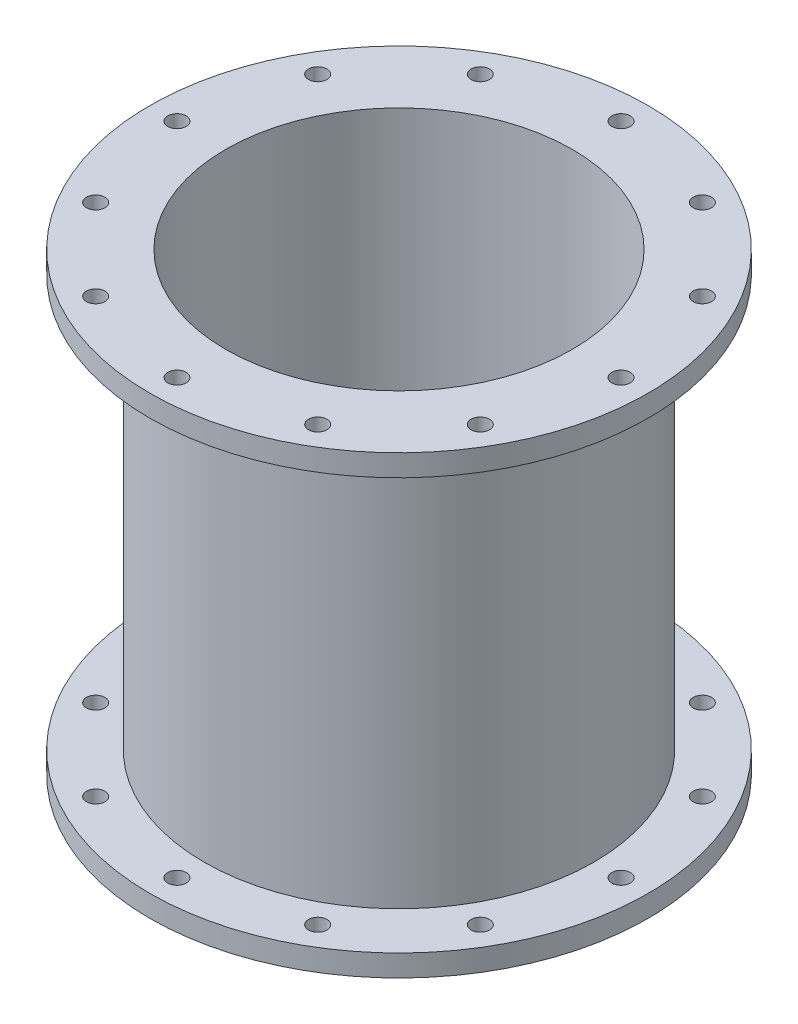
ISO-10303-21;
HEADER;
FILE_DESCRIPTION(('STEP AP214'),'2;1');
FILE_NAME('part.step','',(''),(''),'','','');
FILE_SCHEMA(('AUTOMOTIVE_DESIGN { 1 0 10303 214 1 1 1 1 }'));
ENDSEC;
DATA;
#1=APPLICATION_CONTEXT('core data for automotive mechanical design processes');
#2=APPLICATION_PROTOCOL_DEFINITION('international standard','automotive_design',2000,#1);
#3=PRODUCT_CONTEXT('',#1,'mechanical');
#4=PRODUCT('Part','Part','',(#3));
#5=PRODUCT_RELATED_PRODUCT_CATEGORY('part','',(#4));
#6=PRODUCT_DEFINITION_FORMATION('','',#4);
#7=PRODUCT_DEFINITION_CONTEXT('part definition',#1,'design');
#8=PRODUCT_DEFINITION('design','',#6,#7);
#9=PRODUCT_DEFINITION_SHAPE('','',#8);
#10=(LENGTH_UNIT() NAMED_UNIT(*) SI_UNIT(.MILLI.,.METRE.));
#11=(NAMED_UNIT(*) PLANE_ANGLE_UNIT() SI_UNIT($,.RADIAN.));
#12=(NAMED_UNIT(*) SI_UNIT($,.STERADIAN.) SOLID_ANGLE_UNIT());
#13=UNCERTAINTY_MEASURE_WITH_UNIT(LENGTH_MEASURE(1.E-05),#10,'distance_accuracy_value','');
#14=(GEOMETRIC_REPRESENTATION_CONTEXT(3) GLOBAL_UNCERTAINTY_ASSIGNED_CONTEXT((#13)) GLOBAL_UNIT_ASSIGNED_CONTEXT((#10,
#11,#12)) REPRESENTATION_CONTEXT('',''));
#15=CARTESIAN_POINT('',(0.,0.,0.));
#16=DIRECTION('',(0.,0.,1.));
#17=DIRECTION('',(1.,0.,0.));
#18=AXIS2_PLACEMENT_3D('',#15,#16,#17);
#19=CARTESIAN_POINT('',(0.,0.,0.));
#20=DIRECTION('',(0.,-1.,0.));
#21=DIRECTION('',(0.,0.,-1.));
#22=AXIS2_PLACEMENT_3D('',#19,#20,#21);
#23=CYLINDRICAL_SURFACE('',#22,32.);
#24=CARTESIAN_POINT('',(0.,0.,0.));
#25=DIRECTION('',(0.,-1.,0.));
#26=DIRECTION('',(0.,0.,-1.));
#27=AXIS2_PLACEMENT_3D('',#24,#25,#26);
#28=CIRCLE('',#27,32.);
#29=CARTESIAN_POINT('',(0.,0.,-32.));
#30=VERTEX_POINT('',#29);
#31=EDGE_CURVE('E63',#30,#30,#28,.T.);
#32=ORIENTED_EDGE('',*,*,#31,.T.);
#33=EDGE_LOOP('',(#32));
#34=FACE_BOUND('',#33,.T.);
#35=CARTESIAN_POINT('',(0.,83.9840268711891,0.));
#36=DIRECTION('',(0.,-1.,0.));
#37=DIRECTION('',(0.,0.,-1.));
#38=AXIS2_PLACEMENT_3D('',#35,#36,#37);
#39=CIRCLE('',#38,32.);
#40=CARTESIAN_POINT('',(0.,83.9840268711891,-32.));
#41=VERTEX_POINT('',#40);
#42=EDGE_CURVE('E10',#41,#41,#39,.T.);
#43=ORIENTED_EDGE('',*,*,#42,.F.);
#44=EDGE_LOOP('',(#43));
#45=FACE_BOUND('',#44,.T.);
#46=ADVANCED_FACE('F35',(#34,#45),#23,.F.);
#47=CARTESIAN_POINT('',(0.,83.9840268711891,0.));
#48=DIRECTION('',(0.,1.,0.));
#49=DIRECTION('',(0.,0.,1.));
#50=AXIS2_PLACEMENT_3D('',#47,#48,#49);
#51=PLANE('',#50);
#52=CARTESIAN_POINT('',(-20.4999999999995,83.9840268711891,-35.5070415551622));
#53=DIRECTION('',(0.,1.,0.));
#54=DIRECTION('',(0.,0.,1.));
#55=AXIS2_PLACEMENT_3D('',#52,#53,#54);
#56=CIRCLE('',#55,1.69999999999999);
#57=CARTESIAN_POINT('',(-20.4999999999995,83.9840268711891,-33.8070415551623));
#58=VERTEX_POINT('',#57);
#59=EDGE_CURVE('E141',#58,#58,#56,.T.);
#60=ORIENTED_EDGE('',*,*,#59,.F.);
#61=EDGE_LOOP('',(#60));
#62=FACE_BOUND('',#61,.T.);
#63=CARTESIAN_POINT('',(-35.5070415551617,83.9840268711891,-20.5000000000004));
#64=DIRECTION('',(0.,1.,0.));
#65=DIRECTION('',(0.,0.,1.));
#66=AXIS2_PLACEMENT_3D('',#63,#64,#65);
#67=CIRCLE('',#66,1.69999999999999);
#68=CARTESIAN_POINT('',(-35.5070415551617,83.9840268711891,-18.8000000000004));
#69=VERTEX_POINT('',#68);
#70=EDGE_CURVE('E135',#69,#69,#67,.T.);
#71=ORIENTED_EDGE('',*,*,#70,.F.);
#72=EDGE_LOOP('',(#71));
#73=FACE_BOUND('',#72,.T.);
#74=CARTESIAN_POINT('',(-41.,83.9840268711891,-4.29452204677705E-13));
#75=DIRECTION('',(0.,1.,0.));
#76=DIRECTION('',(0.,0.,1.));
#77=AXIS2_PLACEMENT_3D('',#74,#75,#76);
#78=CIRCLE('',#77,1.69999999999999);
#79=CARTESIAN_POINT('',(-41.,83.9840268711891,1.69999999999956));
#80=VERTEX_POINT('',#79);
#81=EDGE_CURVE('E129',#80,#80,#78,.T.);
#82=ORIENTED_EDGE('',*,*,#81,.F.);
#83=EDGE_LOOP('',(#82));
#84=FACE_BOUND('',#83,.T.);
#85=CARTESIAN_POINT('',(-35.5070415551622,83.9840268711891,20.4999999999997));
#86=DIRECTION('',(0.,1.,0.));
#87=DIRECTION('',(0.,0.,1.));
#88=AXIS2_PLACEMENT_3D('',#85,#86,#87);
#89=CIRCLE('',#88,1.69999999999999);
#90=CARTESIAN_POINT('',(-35.5070415551622,83.9840268711891,22.1999999999997));
#91=VERTEX_POINT('',#90);
#92=EDGE_CURVE('E123',#91,#91,#89,.T.);
#93=ORIENTED_EDGE('',*,*,#92,.F.);
#94=EDGE_LOOP('',(#93));
#95=FACE_BOUND('',#94,.T.);
#96=CARTESIAN_POINT('',(-20.5000000000003,83.9840268711891,35.5070415551618));
#97=DIRECTION('',(0.,1.,0.));
#98=DIRECTION('',(0.,0.,1.));
#99=AXIS2_PLACEMENT_3D('',#96,#97,#98);
#100=CIRCLE('',#99,1.69999999999999);
#101=CARTESIAN_POINT('',(-20.5000000000003,83.9840268711891,37.2070415551618));
#102=VERTEX_POINT('',#101);
#103=EDGE_CURVE('E117',#102,#102,#100,.T.);
#104=ORIENTED_EDGE('',*,*,#103,.F.);
#105=EDGE_LOOP('',(#104));
#106=FACE_BOUND('',#105,.T.);
#107=CARTESIAN_POINT('',(0.,83.9840268711891,41.));
#108=DIRECTION('',(0.,1.,0.));
#109=DIRECTION('',(0.,0.,1.));
#110=AXIS2_PLACEMENT_3D('',#107,#108,#109);
#111=CIRCLE('',#110,1.69999999999999);
#112=CARTESIAN_POINT('',(0.,83.9840268711891,42.7));
#113=VERTEX_POINT('',#112);
#114=EDGE_CURVE('E111',#113,#113,#111,.T.);
#115=ORIENTED_EDGE('',*,*,#114,.F.);
#116=EDGE_LOOP('',(#115));
#117=FACE_BOUND('',#116,.T.);
#118=CARTESIAN_POINT('',(20.4999999999998,83.9840268711891,35.5070415551621));
#119=DIRECTION('',(0.,1.,0.));
#120=DIRECTION('',(0.,0.,1.));
#121=AXIS2_PLACEMENT_3D('',#118,#119,#120);
#122=CIRCLE('',#121,1.69999999999999);
#123=CARTESIAN_POINT('',(20.4999999999998,83.9840268711891,37.2070415551621));
#124=VERTEX_POINT('',#123);
#125=EDGE_CURVE('E105',#124,#124,#122,.T.);
#126=ORIENTED_EDGE('',*,*,#125,.F.);
#127=EDGE_LOOP('',(#126));
#128=FACE_BOUND('',#127,.T.);
#129=CARTESIAN_POINT('',(35.5070415551619,83.9840268711891,20.5000000000002));
#130=DIRECTION('',(0.,1.,0.));
#131=DIRECTION('',(0.,0.,1.));
#132=AXIS2_PLACEMENT_3D('',#129,#130,#131);
#133=CIRCLE('',#132,1.69999999999999);
#134=CARTESIAN_POINT('',(35.5070415551619,83.9840268711891,22.2000000000002));
#135=VERTEX_POINT('',#134);
#136=EDGE_CURVE('E99',#135,#135,#133,.T.);
#137=ORIENTED_EDGE('',*,*,#136,.F.);
#138=EDGE_LOOP('',(#137));
#139=FACE_BOUND('',#138,.T.);
#140=CARTESIAN_POINT('',(41.,83.9840268711891,1.43150734892568E-13));
#141=DIRECTION('',(0.,1.,0.));
#142=DIRECTION('',(0.,0.,1.));
#143=AXIS2_PLACEMENT_3D('',#140,#141,#142);
#144=CIRCLE('',#143,1.69999999999999);
#145=CARTESIAN_POINT('',(41.,83.9840268711891,1.70000000000013));
#146=VERTEX_POINT('',#145);
#147=EDGE_CURVE('E93',#146,#146,#144,.T.);
#148=ORIENTED_EDGE('',*,*,#147,.F.);
#149=EDGE_LOOP('',(#148));
#150=FACE_BOUND('',#149,.T.);
#151=CARTESIAN_POINT('',(35.507041555162,83.9840268711891,-20.4999999999999));
#152=DIRECTION('',(0.,1.,0.));
#153=DIRECTION('',(0.,0.,1.));
#154=AXIS2_PLACEMENT_3D('',#151,#152,#153);
#155=CIRCLE('',#154,1.69999999999999);
#156=CARTESIAN_POINT('',(35.507041555162,83.9840268711891,-18.7999999999999));
#157=VERTEX_POINT('',#156);
#158=EDGE_CURVE('E87',#157,#157,#155,.T.);
#159=ORIENTED_EDGE('',*,*,#158,.F.);
#160=EDGE_LOOP('',(#159));
#161=FACE_BOUND('',#160,.T.);
#162=CARTESIAN_POINT('',(20.5,83.9840268711891,-35.507041555162));
#163=DIRECTION('',(0.,1.,0.));
#164=DIRECTION('',(0.,0.,1.));
#165=AXIS2_PLACEMENT_3D('',#162,#163,#164);
#166=CIRCLE('',#165,1.69999999999999);
#167=CARTESIAN_POINT('',(20.5,83.9840268711891,-33.807041555162));
#168=VERTEX_POINT('',#167);
#169=EDGE_CURVE('E81',#168,#168,#166,.T.);
#170=ORIENTED_EDGE('',*,*,#169,.F.);
#171=EDGE_LOOP('',(#170));
#172=FACE_BOUND('',#171,.T.);
#173=CARTESIAN_POINT('',(0.,83.9840268711891,-41.));
#174=DIRECTION('',(0.,1.,0.));
#175=DIRECTION('',(0.,0.,1.));
#176=AXIS2_PLACEMENT_3D('',#173,#174,#175);
#177=CIRCLE('',#176,1.69999999999999);
#178=CARTESIAN_POINT('',(0.,83.9840268711891,-39.3));
#179=VERTEX_POINT('',#178);
#180=EDGE_CURVE('E69',#179,#179,#177,.T.);
#181=ORIENTED_EDGE('',*,*,#180,.F.);
#182=EDGE_LOOP('',(#181));
#183=FACE_BOUND('',#182,.T.);
#184=ORIENTED_EDGE('',*,*,#42,.T.);
#185=EDGE_LOOP('',(#184));
#186=FACE_BOUND('',#185,.T.);
#187=CARTESIAN_POINT('',(0.,83.9840268711891,0.));
#188=DIRECTION('',(0.,-1.,0.));
#189=DIRECTION('',(0.,0.,-1.));
#190=AXIS2_PLACEMENT_3D('',#187,#188,#189);
#191=CIRCLE('',#190,46.);
#192=CARTESIAN_POINT('',(0.,83.9840268711891,-46.));
#193=VERTEX_POINT('',#192);
#194=EDGE_CURVE('E41',#193,#193,#191,.T.);
#195=ORIENTED_EDGE('',*,*,#194,.F.);
#196=EDGE_LOOP('',(#195));
#197=FACE_BOUND('',#196,.T.);
#198=ADVANCED_FACE('F248',(#62,#73,#84,#95,#106,#117,#128,#139,#150,#161,#172,#183,#186,#197),
#51,.T.);
#199=CARTESIAN_POINT('',(0.,0.,0.));
#200=DIRECTION('',(0.,-1.,0.));
#201=DIRECTION('',(0.,0.,-1.));
#202=AXIS2_PLACEMENT_3D('',#199,#200,#201);
#203=CYLINDRICAL_SURFACE('',#202,46.);
#204=ORIENTED_EDGE('',*,*,#194,.T.);
#205=EDGE_LOOP('',(#204));
#206=FACE_BOUND('',#205,.T.);
#207=CARTESIAN_POINT('',(0.,79.9840268711891,0.));
#208=DIRECTION('',(0.,-1.,0.));
#209=DIRECTION('',(0.,0.,-1.));
#210=AXIS2_PLACEMENT_3D('',#207,#208,#209);
#211=CIRCLE('',#210,46.);
#212=CARTESIAN_POINT('',(0.,79.9840268711891,-46.));
#213=VERTEX_POINT('',#212);
#214=EDGE_CURVE('E45',#213,#213,#211,.T.);
#215=ORIENTED_EDGE('',*,*,#214,.F.);
#216=EDGE_LOOP('',(#215));
#217=FACE_BOUND('',#216,.T.);
#218=ADVANCED_FACE('F252',(#206,#217),#203,.T.);
#219=CARTESIAN_POINT('',(0.,79.9840268711891,0.));
#220=DIRECTION('',(0.,-1.,0.));
#221=DIRECTION('',(0.,0.,-1.));
#222=AXIS2_PLACEMENT_3D('',#219,#220,#221);
#223=PLANE('',#222);
#224=CARTESIAN_POINT('',(-20.4999999999995,79.9840268711891,-35.5070415551622));
#225=DIRECTION('',(0.,-1.,0.));
#226=DIRECTION('',(0.,0.,-1.));
#227=AXIS2_PLACEMENT_3D('',#224,#225,#226);
#228=CIRCLE('',#227,1.69999999999999);
#229=CARTESIAN_POINT('',(-20.4999999999995,79.9840268711891,-37.2070415551622));
#230=VERTEX_POINT('',#229);
#231=EDGE_CURVE('E138',#230,#230,#228,.T.);
#232=ORIENTED_EDGE('',*,*,#231,.F.);
#233=EDGE_LOOP('',(#232));
#234=FACE_BOUND('',#233,.T.);
#235=CARTESIAN_POINT('',(-35.5070415551617,79.9840268711891,-20.5000000000004));
#236=DIRECTION('',(0.,-1.,0.));
#237=DIRECTION('',(0.,0.,-1.));
#238=AXIS2_PLACEMENT_3D('',#235,#236,#237);
#239=CIRCLE('',#238,1.69999999999999);
#240=CARTESIAN_POINT('',(-35.5070415551617,79.9840268711891,-22.2000000000004));
#241=VERTEX_POINT('',#240);
#242=EDGE_CURVE('E132',#241,#241,#239,.T.);
#243=ORIENTED_EDGE('',*,*,#242,.F.);
#244=EDGE_LOOP('',(#243));
#245=FACE_BOUND('',#244,.T.);
#246=CARTESIAN_POINT('',(-41.,79.9840268711891,-4.29452204677705E-13));
#247=DIRECTION('',(0.,-1.,0.));
#248=DIRECTION('',(0.,0.,-1.));
#249=AXIS2_PLACEMENT_3D('',#246,#247,#248);
#250=CIRCLE('',#249,1.69999999999999);
#251=CARTESIAN_POINT('',(-41.,79.9840268711891,-1.70000000000042));
#252=VERTEX_POINT('',#251);
#253=EDGE_CURVE('E126',#252,#252,#250,.T.);
#254=ORIENTED_EDGE('',*,*,#253,.F.);
#255=EDGE_LOOP('',(#254));
#256=FACE_BOUND('',#255,.T.);
#257=CARTESIAN_POINT('',(-35.5070415551622,79.9840268711891,20.4999999999997));
#258=DIRECTION('',(0.,-1.,0.));
#259=DIRECTION('',(0.,0.,-1.));
#260=AXIS2_PLACEMENT_3D('',#257,#258,#259);
#261=CIRCLE('',#260,1.69999999999999);
#262=CARTESIAN_POINT('',(-35.5070415551622,79.9840268711891,18.7999999999997));
#263=VERTEX_POINT('',#262);
#264=EDGE_CURVE('E120',#263,#263,#261,.T.);
#265=ORIENTED_EDGE('',*,*,#264,.F.);
#266=EDGE_LOOP('',(#265));
#267=FACE_BOUND('',#266,.T.);
#268=CARTESIAN_POINT('',(-20.5000000000003,79.9840268711891,35.5070415551618));
#269=DIRECTION('',(0.,-1.,0.));
#270=DIRECTION('',(0.,0.,-1.));
#271=AXIS2_PLACEMENT_3D('',#268,#269,#270);
#272=CIRCLE('',#271,1.69999999999999);
#273=CARTESIAN_POINT('',(-20.5000000000003,79.9840268711891,33.8070415551618));
#274=VERTEX_POINT('',#273);
#275=EDGE_CURVE('E114',#274,#274,#272,.T.);
#276=ORIENTED_EDGE('',*,*,#275,.F.);
#277=EDGE_LOOP('',(#276));
#278=FACE_BOUND('',#277,.T.);
#279=CARTESIAN_POINT('',(0.,79.9840268711891,41.));
#280=DIRECTION('',(0.,-1.,0.));
#281=DIRECTION('',(0.,0.,-1.));
#282=AXIS2_PLACEMENT_3D('',#279,#280,#281);
#283=CIRCLE('',#282,1.69999999999999);
#284=CARTESIAN_POINT('',(0.,79.9840268711891,39.3));
#285=VERTEX_POINT('',#284);
#286=EDGE_CURVE('E108',#285,#285,#283,.T.);
#287=ORIENTED_EDGE('',*,*,#286,.F.);
#288=EDGE_LOOP('',(#287));
#289=FACE_BOUND('',#288,.T.);
#290=CARTESIAN_POINT('',(20.4999999999998,79.9840268711891,35.5070415551621));
#291=DIRECTION('',(0.,-1.,0.));
#292=DIRECTION('',(0.,0.,-1.));
#293=AXIS2_PLACEMENT_3D('',#290,#291,#292);
#294=CIRCLE('',#293,1.69999999999999);
#295=CARTESIAN_POINT('',(20.4999999999998,79.9840268711891,33.8070415551621));
#296=VERTEX_POINT('',#295);
#297=EDGE_CURVE('E102',#296,#296,#294,.T.);
#298=ORIENTED_EDGE('',*,*,#297,.F.);
#299=EDGE_LOOP('',(#298));
#300=FACE_BOUND('',#299,.T.);
#301=CARTESIAN_POINT('',(35.5070415551619,79.9840268711891,20.5000000000002));
#302=DIRECTION('',(0.,-1.,0.));
#303=DIRECTION('',(0.,0.,-1.));
#304=AXIS2_PLACEMENT_3D('',#301,#302,#303);
#305=CIRCLE('',#304,1.69999999999999);
#306=CARTESIAN_POINT('',(35.5070415551619,79.9840268711891,18.8000000000002));
#307=VERTEX_POINT('',#306);
#308=EDGE_CURVE('E96',#307,#307,#305,.T.);
#309=ORIENTED_EDGE('',*,*,#308,.F.);
#310=EDGE_LOOP('',(#309));
#311=FACE_BOUND('',#310,.T.);
#312=CARTESIAN_POINT('',(41.,79.9840268711891,1.43150734892568E-13));
#313=DIRECTION('',(0.,-1.,0.));
#314=DIRECTION('',(0.,0.,-1.));
#315=AXIS2_PLACEMENT_3D('',#312,#313,#314);
#316=CIRCLE('',#315,1.69999999999999);
#317=CARTESIAN_POINT('',(41.,79.9840268711891,-1.69999999999985));
#318=VERTEX_POINT('',#317);
#319=EDGE_CURVE('E90',#318,#318,#316,.T.);
#320=ORIENTED_EDGE('',*,*,#319,.F.);
#321=EDGE_LOOP('',(#320));
#322=FACE_BOUND('',#321,.T.);
#323=CARTESIAN_POINT('',(35.507041555162,79.9840268711891,-20.4999999999999));
#324=DIRECTION('',(0.,-1.,0.));
#325=DIRECTION('',(0.,0.,-1.));
#326=AXIS2_PLACEMENT_3D('',#323,#324,#325);
#327=CIRCLE('',#326,1.69999999999999);
#328=CARTESIAN_POINT('',(35.507041555162,79.9840268711891,-22.1999999999999));
#329=VERTEX_POINT('',#328);
#330=EDGE_CURVE('E84',#329,#329,#327,.T.);
#331=ORIENTED_EDGE('',*,*,#330,.F.);
#332=EDGE_LOOP('',(#331));
#333=FACE_BOUND('',#332,.T.);
#334=CARTESIAN_POINT('',(20.5,79.9840268711891,-35.507041555162));
#335=DIRECTION('',(0.,-1.,0.));
#336=DIRECTION('',(0.,0.,-1.));
#337=AXIS2_PLACEMENT_3D('',#334,#335,#336);
#338=CIRCLE('',#337,1.69999999999999);
#339=CARTESIAN_POINT('',(20.5,79.9840268711891,-37.207041555162));
#340=VERTEX_POINT('',#339);
#341=EDGE_CURVE('E78',#340,#340,#338,.T.);
#342=ORIENTED_EDGE('',*,*,#341,.F.);
#343=EDGE_LOOP('',(#342));
#344=FACE_BOUND('',#343,.T.);
#345=CARTESIAN_POINT('',(0.,79.9840268711891,-41.));
#346=DIRECTION('',(0.,-1.,0.));
#347=DIRECTION('',(0.,0.,-1.));
#348=AXIS2_PLACEMENT_3D('',#345,#346,#347);
#349=CIRCLE('',#348,1.69999999999999);
#350=CARTESIAN_POINT('',(0.,79.9840268711891,-42.7));
#351=VERTEX_POINT('',#350);
#352=EDGE_CURVE('E66',#351,#351,#349,.T.);
#353=ORIENTED_EDGE('',*,*,#352,.F.);
#354=EDGE_LOOP('',(#353));
#355=FACE_BOUND('',#354,.T.);
#356=ORIENTED_EDGE('',*,*,#214,.T.);
#357=EDGE_LOOP('',(#356));
#358=FACE_BOUND('',#357,.T.);
#359=CARTESIAN_POINT('',(0.,79.9840268711891,0.));
#360=DIRECTION('',(0.,-1.,0.));
#361=DIRECTION('',(0.,0.,-1.));
#362=AXIS2_PLACEMENT_3D('',#359,#360,#361);
#363=CIRCLE('',#362,36.);
#364=CARTESIAN_POINT('',(0.,79.9840268711891,-36.));
#365=VERTEX_POINT('',#364);
#366=EDGE_CURVE('E49',#365,#365,#363,.T.);
#367=ORIENTED_EDGE('',*,*,#366,.F.);
#368=EDGE_LOOP('',(#367));
#369=FACE_BOUND('',#368,.T.);
#370=ADVANCED_FACE('F257',(#234,#245,#256,#267,#278,#289,#300,#311,#322,#333,#344,#355,#358,
#369),#223,.T.);
#371=CARTESIAN_POINT('',(0.,0.,0.));
#372=DIRECTION('',(0.,-1.,0.));
#373=DIRECTION('',(0.,0.,-1.));
#374=AXIS2_PLACEMENT_3D('',#371,#372,#373);
#375=CYLINDRICAL_SURFACE('',#374,36.);
#376=ORIENTED_EDGE('',*,*,#366,.T.);
#377=EDGE_LOOP('',(#376));
#378=FACE_BOUND('',#377,.T.);
#379=CARTESIAN_POINT('',(0.,4.,0.));
#380=DIRECTION('',(0.,-1.,0.));
#381=DIRECTION('',(0.,0.,-1.));
#382=AXIS2_PLACEMENT_3D('',#379,#380,#381);
#383=CIRCLE('',#382,36.);
#384=CARTESIAN_POINT('',(0.,4.,-36.));
#385=VERTEX_POINT('',#384);
#386=EDGE_CURVE('E54',#385,#385,#383,.T.);
#387=ORIENTED_EDGE('',*,*,#386,.F.);
#388=EDGE_LOOP('',(#387));
#389=FACE_BOUND('',#388,.T.);
#390=ADVANCED_FACE('F264',(#378,#389),#375,.T.);
#391=CARTESIAN_POINT('',(0.,4.,0.));
#392=DIRECTION('',(0.,1.,0.));
#393=DIRECTION('',(0.,0.,1.));
#394=AXIS2_PLACEMENT_3D('',#391,#392,#393);
#395=PLANE('',#394);
#396=CARTESIAN_POINT('',(-20.4999999999995,4.,-35.5070415551622));
#397=DIRECTION('',(0.,1.,0.));
#398=DIRECTION('',(0.,0.,1.));
#399=AXIS2_PLACEMENT_3D('',#396,#397,#398);
#400=CIRCLE('',#399,1.69999999999999);
#401=CARTESIAN_POINT('',(-20.4999999999995,4.,-33.8070415551623));
#402=VERTEX_POINT('',#401);
#403=EDGE_CURVE('E204',#402,#402,#400,.T.);
#404=ORIENTED_EDGE('',*,*,#403,.F.);
#405=EDGE_LOOP('',(#404));
#406=FACE_BOUND('',#405,.T.);
#407=CARTESIAN_POINT('',(-35.5070415551617,4.,-20.5000000000004));
#408=DIRECTION('',(0.,1.,0.));
#409=DIRECTION('',(0.,0.,1.));
#410=AXIS2_PLACEMENT_3D('',#407,#408,#409);
#411=CIRCLE('',#410,1.69999999999999);
#412=CARTESIAN_POINT('',(-35.5070415551617,4.,-18.8000000000004));
#413=VERTEX_POINT('',#412);
#414=EDGE_CURVE('E198',#413,#413,#411,.T.);
#415=ORIENTED_EDGE('',*,*,#414,.F.);
#416=EDGE_LOOP('',(#415));
#417=FACE_BOUND('',#416,.T.);
#418=CARTESIAN_POINT('',(-41.,4.,-4.29452204677705E-13));
#419=DIRECTION('',(0.,1.,0.));
#420=DIRECTION('',(0.,0.,1.));
#421=AXIS2_PLACEMENT_3D('',#418,#419,#420);
#422=CIRCLE('',#421,1.69999999999999);
#423=CARTESIAN_POINT('',(-41.,4.,1.69999999999956));
#424=VERTEX_POINT('',#423);
#425=EDGE_CURVE('E192',#424,#424,#422,.T.);
#426=ORIENTED_EDGE('',*,*,#425,.F.);
#427=EDGE_LOOP('',(#426));
#428=FACE_BOUND('',#427,.T.);
#429=CARTESIAN_POINT('',(-35.5070415551622,4.,20.4999999999997));
#430=DIRECTION('',(0.,1.,0.));
#431=DIRECTION('',(0.,0.,1.));
#432=AXIS2_PLACEMENT_3D('',#429,#430,#431);
#433=CIRCLE('',#432,1.69999999999999);
#434=CARTESIAN_POINT('',(-35.5070415551622,4.,22.1999999999997));
#435=VERTEX_POINT('',#434);
#436=EDGE_CURVE('E186',#435,#435,#433,.T.);
#437=ORIENTED_EDGE('',*,*,#436,.F.);
#438=EDGE_LOOP('',(#437));
#439=FACE_BOUND('',#438,.T.);
#440=CARTESIAN_POINT('',(-20.5000000000003,4.,35.5070415551618));
#441=DIRECTION('',(0.,1.,0.));
#442=DIRECTION('',(0.,0.,1.));
#443=AXIS2_PLACEMENT_3D('',#440,#441,#442);
#444=CIRCLE('',#443,1.69999999999999);
#445=CARTESIAN_POINT('',(-20.5000000000003,4.,37.2070415551618));
#446=VERTEX_POINT('',#445);
#447=EDGE_CURVE('E180',#446,#446,#444,.T.);
#448=ORIENTED_EDGE('',*,*,#447,.F.);
#449=EDGE_LOOP('',(#448));
#450=FACE_BOUND('',#449,.T.);
#451=CARTESIAN_POINT('',(0.,4.,41.));
#452=DIRECTION('',(0.,1.,0.));
#453=DIRECTION('',(0.,0.,1.));
#454=AXIS2_PLACEMENT_3D('',#451,#452,#453);
#455=CIRCLE('',#454,1.69999999999999);
#456=CARTESIAN_POINT('',(0.,4.,42.7));
#457=VERTEX_POINT('',#456);
#458=EDGE_CURVE('E174',#457,#457,#455,.T.);
#459=ORIENTED_EDGE('',*,*,#458,.F.);
#460=EDGE_LOOP('',(#459));
#461=FACE_BOUND('',#460,.T.);
#462=CARTESIAN_POINT('',(20.4999999999998,4.,35.5070415551621));
#463=DIRECTION('',(0.,1.,0.));
#464=DIRECTION('',(0.,0.,1.));
#465=AXIS2_PLACEMENT_3D('',#462,#463,#464);
#466=CIRCLE('',#465,1.69999999999999);
#467=CARTESIAN_POINT('',(20.4999999999998,4.,37.2070415551621));
#468=VERTEX_POINT('',#467);
#469=EDGE_CURVE('E168',#468,#468,#466,.T.);
#470=ORIENTED_EDGE('',*,*,#469,.F.);
#471=EDGE_LOOP('',(#470));
#472=FACE_BOUND('',#471,.T.);
#473=CARTESIAN_POINT('',(35.5070415551619,4.,20.5000000000002));
#474=DIRECTION('',(0.,1.,0.));
#475=DIRECTION('',(0.,0.,1.));
#476=AXIS2_PLACEMENT_3D('',#473,#474,#475);
#477=CIRCLE('',#476,1.69999999999999);
#478=CARTESIAN_POINT('',(35.5070415551619,4.,22.2000000000002));
#479=VERTEX_POINT('',#478);
#480=EDGE_CURVE('E162',#479,#479,#477,.T.);
#481=ORIENTED_EDGE('',*,*,#480,.F.);
#482=EDGE_LOOP('',(#481));
#483=FACE_BOUND('',#482,.T.);
#484=CARTESIAN_POINT('',(41.,4.,1.43150734892568E-13));
#485=DIRECTION('',(0.,1.,0.));
#486=DIRECTION('',(0.,0.,1.));
#487=AXIS2_PLACEMENT_3D('',#484,#485,#486);
#488=CIRCLE('',#487,1.69999999999999);
#489=CARTESIAN_POINT('',(41.,4.,1.70000000000014));
#490=VERTEX_POINT('',#489);
#491=EDGE_CURVE('E156',#490,#490,#488,.T.);
#492=ORIENTED_EDGE('',*,*,#491,.F.);
#493=EDGE_LOOP('',(#492));
#494=FACE_BOUND('',#493,.T.);
#495=CARTESIAN_POINT('',(35.507041555162,4.,-20.4999999999999));
#496=DIRECTION('',(0.,1.,0.));
#497=DIRECTION('',(0.,0.,1.));
#498=AXIS2_PLACEMENT_3D('',#495,#496,#497);
#499=CIRCLE('',#498,1.69999999999999);
#500=CARTESIAN_POINT('',(35.507041555162,4.,-18.7999999999999));
#501=VERTEX_POINT('',#500);
#502=EDGE_CURVE('E150',#501,#501,#499,.T.);
#503=ORIENTED_EDGE('',*,*,#502,.F.);
#504=EDGE_LOOP('',(#503));
#505=FACE_BOUND('',#504,.T.);
#506=CARTESIAN_POINT('',(20.5,4.,-35.507041555162));
#507=DIRECTION('',(0.,1.,0.));
#508=DIRECTION('',(0.,0.,1.));
#509=AXIS2_PLACEMENT_3D('',#506,#507,#508);
#510=CIRCLE('',#509,1.69999999999999);
#511=CARTESIAN_POINT('',(20.5,4.,-33.807041555162));
#512=VERTEX_POINT('',#511);
#513=EDGE_CURVE('E144',#512,#512,#510,.T.);
#514=ORIENTED_EDGE('',*,*,#513,.F.);
#515=EDGE_LOOP('',(#514));
#516=FACE_BOUND('',#515,.T.);
#517=CARTESIAN_POINT('',(0.,4.,-41.));
#518=DIRECTION('',(0.,1.,0.));
#519=DIRECTION('',(0.,0.,1.));
#520=AXIS2_PLACEMENT_3D('',#517,#518,#519);
#521=CIRCLE('',#520,1.69999999999999);
#522=CARTESIAN_POINT('',(0.,4.,-39.3));
#523=VERTEX_POINT('',#522);
#524=EDGE_CURVE('E72',#523,#523,#521,.T.);
#525=ORIENTED_EDGE('',*,*,#524,.F.);
#526=EDGE_LOOP('',(#525));
#527=FACE_BOUND('',#526,.T.);
#528=ORIENTED_EDGE('',*,*,#386,.T.);
#529=EDGE_LOOP('',(#528));
#530=FACE_BOUND('',#529,.T.);
#531=CARTESIAN_POINT('',(0.,4.,0.));
#532=DIRECTION('',(0.,-1.,0.));
#533=DIRECTION('',(0.,0.,-1.));
#534=AXIS2_PLACEMENT_3D('',#531,#532,#533);
#535=CIRCLE('',#534,46.);
#536=CARTESIAN_POINT('',(0.,4.,-46.));
#537=VERTEX_POINT('',#536);
#538=EDGE_CURVE('E57',#537,#537,#535,.T.);
#539=ORIENTED_EDGE('',*,*,#538,.F.);
#540=EDGE_LOOP('',(#539));
#541=FACE_BOUND('',#540,.T.);
#542=ADVANCED_FACE('F268',(#406,#417,#428,#439,#450,#461,#472,#483,#494,#505,#516,#527,#530,
#541),#395,.T.);
#543=CARTESIAN_POINT('',(0.,0.,0.));
#544=DIRECTION('',(0.,-1.,0.));
#545=DIRECTION('',(0.,0.,-1.));
#546=AXIS2_PLACEMENT_3D('',#543,#544,#545);
#547=CYLINDRICAL_SURFACE('',#546,46.);
#548=ORIENTED_EDGE('',*,*,#538,.T.);
#549=EDGE_LOOP('',(#548));
#550=FACE_BOUND('',#549,.T.);
#551=CARTESIAN_POINT('',(0.,0.,0.));
#552=DIRECTION('',(0.,-1.,0.));
#553=DIRECTION('',(0.,0.,-1.));
#554=AXIS2_PLACEMENT_3D('',#551,#552,#553);
#555=CIRCLE('',#554,46.);
#556=CARTESIAN_POINT('',(0.,0.,-46.));
#557=VERTEX_POINT('',#556);
#558=EDGE_CURVE('E60',#557,#557,#555,.T.);
#559=ORIENTED_EDGE('',*,*,#558,.F.);
#560=EDGE_LOOP('',(#559));
#561=FACE_BOUND('',#560,.T.);
#562=ADVANCED_FACE('F218',(#550,#561),#547,.T.);
#563=CARTESIAN_POINT('',(0.,0.,0.));
#564=DIRECTION('',(0.,-1.,0.));
#565=DIRECTION('',(0.,0.,-1.));
#566=AXIS2_PLACEMENT_3D('',#563,#564,#565);
#567=PLANE('',#566);
#568=CARTESIAN_POINT('',(-20.4999999999995,0.,-35.5070415551622));
#569=DIRECTION('',(0.,-1.,0.));
#570=DIRECTION('',(0.,0.,-1.));
#571=AXIS2_PLACEMENT_3D('',#568,#569,#570);
#572=CIRCLE('',#571,1.69999999999999);
#573=CARTESIAN_POINT('',(-20.4999999999995,0.,-37.2070415551622));
#574=VERTEX_POINT('',#573);
#575=EDGE_CURVE('E207',#574,#574,#572,.T.);
#576=ORIENTED_EDGE('',*,*,#575,.F.);
#577=EDGE_LOOP('',(#576));
#578=FACE_BOUND('',#577,.T.);
#579=CARTESIAN_POINT('',(-35.5070415551617,0.,-20.5000000000004));
#580=DIRECTION('',(0.,-1.,0.));
#581=DIRECTION('',(0.,0.,-1.));
#582=AXIS2_PLACEMENT_3D('',#579,#580,#581);
#583=CIRCLE('',#582,1.69999999999999);
#584=CARTESIAN_POINT('',(-35.5070415551617,0.,-22.2000000000004));
#585=VERTEX_POINT('',#584);
#586=EDGE_CURVE('E201',#585,#585,#583,.T.);
#587=ORIENTED_EDGE('',*,*,#586,.F.);
#588=EDGE_LOOP('',(#587));
#589=FACE_BOUND('',#588,.T.);
#590=CARTESIAN_POINT('',(-41.,0.,-4.29452204677705E-13));
#591=DIRECTION('',(0.,-1.,0.));
#592=DIRECTION('',(0.,0.,-1.));
#593=AXIS2_PLACEMENT_3D('',#590,#591,#592);
#594=CIRCLE('',#593,1.69999999999999);
#595=CARTESIAN_POINT('',(-41.,0.,-1.70000000000042));
#596=VERTEX_POINT('',#595);
#597=EDGE_CURVE('E195',#596,#596,#594,.T.);
#598=ORIENTED_EDGE('',*,*,#597,.F.);
#599=EDGE_LOOP('',(#598));
#600=FACE_BOUND('',#599,.T.);
#601=CARTESIAN_POINT('',(-35.5070415551622,0.,20.4999999999997));
#602=DIRECTION('',(0.,-1.,0.));
#603=DIRECTION('',(0.,0.,-1.));
#604=AXIS2_PLACEMENT_3D('',#601,#602,#603);
#605=CIRCLE('',#604,1.69999999999999);
#606=CARTESIAN_POINT('',(-35.5070415551622,0.,18.7999999999997));
#607=VERTEX_POINT('',#606);
#608=EDGE_CURVE('E189',#607,#607,#605,.T.);
#609=ORIENTED_EDGE('',*,*,#608,.F.);
#610=EDGE_LOOP('',(#609));
#611=FACE_BOUND('',#610,.T.);
#612=CARTESIAN_POINT('',(-20.5000000000003,0.,35.5070415551618));
#613=DIRECTION('',(0.,-1.,0.));
#614=DIRECTION('',(0.,0.,-1.));
#615=AXIS2_PLACEMENT_3D('',#612,#613,#614);
#616=CIRCLE('',#615,1.69999999999999);
#617=CARTESIAN_POINT('',(-20.5000000000003,0.,33.8070415551618));
#618=VERTEX_POINT('',#617);
#619=EDGE_CURVE('E183',#618,#618,#616,.T.);
#620=ORIENTED_EDGE('',*,*,#619,.F.);
#621=EDGE_LOOP('',(#620));
#622=FACE_BOUND('',#621,.T.);
#623=CARTESIAN_POINT('',(0.,0.,41.));
#624=DIRECTION('',(0.,-1.,0.));
#625=DIRECTION('',(0.,0.,-1.));
#626=AXIS2_PLACEMENT_3D('',#623,#624,#625);
#627=CIRCLE('',#626,1.69999999999999);
#628=CARTESIAN_POINT('',(0.,0.,39.3));
#629=VERTEX_POINT('',#628);
#630=EDGE_CURVE('E177',#629,#629,#627,.T.);
#631=ORIENTED_EDGE('',*,*,#630,.F.);
#632=EDGE_LOOP('',(#631));
#633=FACE_BOUND('',#632,.T.);
#634=CARTESIAN_POINT('',(20.4999999999998,0.,35.5070415551621));
#635=DIRECTION('',(0.,-1.,0.));
#636=DIRECTION('',(0.,0.,-1.));
#637=AXIS2_PLACEMENT_3D('',#634,#635,#636);
#638=CIRCLE('',#637,1.69999999999999);
#639=CARTESIAN_POINT('',(20.4999999999998,0.,33.8070415551621));
#640=VERTEX_POINT('',#639);
#641=EDGE_CURVE('E171',#640,#640,#638,.T.);
#642=ORIENTED_EDGE('',*,*,#641,.F.);
#643=EDGE_LOOP('',(#642));
#644=FACE_BOUND('',#643,.T.);
#645=CARTESIAN_POINT('',(35.5070415551619,0.,20.5000000000002));
#646=DIRECTION('',(0.,-1.,0.));
#647=DIRECTION('',(0.,0.,-1.));
#648=AXIS2_PLACEMENT_3D('',#645,#646,#647);
#649=CIRCLE('',#648,1.69999999999999);
#650=CARTESIAN_POINT('',(35.5070415551619,0.,18.8000000000002));
#651=VERTEX_POINT('',#650);
#652=EDGE_CURVE('E165',#651,#651,#649,.T.);
#653=ORIENTED_EDGE('',*,*,#652,.F.);
#654=EDGE_LOOP('',(#653));
#655=FACE_BOUND('',#654,.T.);
#656=CARTESIAN_POINT('',(41.,0.,1.43150734892568E-13));
#657=DIRECTION('',(0.,-1.,0.));
#658=DIRECTION('',(0.,0.,-1.));
#659=AXIS2_PLACEMENT_3D('',#656,#657,#658);
#660=CIRCLE('',#659,1.69999999999999);
#661=CARTESIAN_POINT('',(41.,0.,-1.69999999999984));
#662=VERTEX_POINT('',#661);
#663=EDGE_CURVE('E159',#662,#662,#660,.T.);
#664=ORIENTED_EDGE('',*,*,#663,.F.);
#665=EDGE_LOOP('',(#664));
#666=FACE_BOUND('',#665,.T.);
#667=CARTESIAN_POINT('',(35.507041555162,0.,-20.4999999999999));
#668=DIRECTION('',(0.,-1.,0.));
#669=DIRECTION('',(0.,0.,-1.));
#670=AXIS2_PLACEMENT_3D('',#667,#668,#669);
#671=CIRCLE('',#670,1.69999999999999);
#672=CARTESIAN_POINT('',(35.507041555162,0.,-22.1999999999999));
#673=VERTEX_POINT('',#672);
#674=EDGE_CURVE('E153',#673,#673,#671,.T.);
#675=ORIENTED_EDGE('',*,*,#674,.F.);
#676=EDGE_LOOP('',(#675));
#677=FACE_BOUND('',#676,.T.);
#678=CARTESIAN_POINT('',(20.5,0.,-35.507041555162));
#679=DIRECTION('',(0.,-1.,0.));
#680=DIRECTION('',(0.,0.,-1.));
#681=AXIS2_PLACEMENT_3D('',#678,#679,#680);
#682=CIRCLE('',#681,1.69999999999999);
#683=CARTESIAN_POINT('',(20.5,0.,-37.207041555162));
#684=VERTEX_POINT('',#683);
#685=EDGE_CURVE('E147',#684,#684,#682,.T.);
#686=ORIENTED_EDGE('',*,*,#685,.F.);
#687=EDGE_LOOP('',(#686));
#688=FACE_BOUND('',#687,.T.);
#689=CARTESIAN_POINT('',(0.,0.,-41.));
#690=DIRECTION('',(0.,-1.,0.));
#691=DIRECTION('',(0.,0.,-1.));
#692=AXIS2_PLACEMENT_3D('',#689,#690,#691);
#693=CIRCLE('',#692,1.69999999999999);
#694=CARTESIAN_POINT('',(0.,0.,-42.7));
#695=VERTEX_POINT('',#694);
#696=EDGE_CURVE('E75',#695,#695,#693,.T.);
#697=ORIENTED_EDGE('',*,*,#696,.F.);
#698=EDGE_LOOP('',(#697));
#699=FACE_BOUND('',#698,.T.);
#700=ORIENTED_EDGE('',*,*,#558,.T.);
#701=EDGE_LOOP('',(#700));
#702=FACE_BOUND('',#701,.T.);
#703=ORIENTED_EDGE('',*,*,#31,.F.);
#704=EDGE_LOOP('',(#703));
#705=FACE_BOUND('',#704,.T.);
#706=ADVANCED_FACE('F214',(#578,#589,#600,#611,#622,#633,#644,#655,#666,#677,#688,#699,#702,
#705),#567,.T.);
#707=CARTESIAN_POINT('',(0.,83.9840268711891,-41.));
#708=DIRECTION('',(0.,1.,0.));
#709=DIRECTION('',(0.,0.,1.));
#710=AXIS2_PLACEMENT_3D('',#707,#708,#709);
#711=CYLINDRICAL_SURFACE('',#710,1.69999999999999);
#712=ORIENTED_EDGE('',*,*,#180,.T.);
#713=EDGE_LOOP('',(#712));
#714=FACE_BOUND('',#713,.T.);
#715=ORIENTED_EDGE('',*,*,#352,.T.);
#716=EDGE_LOOP('',(#715));
#717=FACE_BOUND('',#716,.T.);
#718=ADVANCED_FACE('F217',(#714,#717),#711,.F.);
#719=CARTESIAN_POINT('',(0.,0.,-41.));
#720=DIRECTION('',(0.,-1.,0.));
#721=DIRECTION('',(0.,0.,-1.));
#722=AXIS2_PLACEMENT_3D('',#719,#720,#721);
#723=CYLINDRICAL_SURFACE('',#722,1.69999999999999);
#724=ORIENTED_EDGE('',*,*,#696,.T.);
#725=EDGE_LOOP('',(#724));
#726=FACE_BOUND('',#725,.T.);
#727=ORIENTED_EDGE('',*,*,#524,.T.);
#728=EDGE_LOOP('',(#727));
#729=FACE_BOUND('',#728,.T.);
#730=ADVANCED_FACE('F278',(#726,#729),#723,.F.);
#731=CARTESIAN_POINT('',(20.5,83.9840268711891,-35.507041555162));
#732=DIRECTION('',(0.,1.,0.));
#733=DIRECTION('',(0.,0.,1.));
#734=AXIS2_PLACEMENT_3D('',#731,#732,#733);
#735=CYLINDRICAL_SURFACE('',#734,1.69999999999999);
#736=ORIENTED_EDGE('',*,*,#169,.T.);
#737=EDGE_LOOP('',(#736));
#738=FACE_BOUND('',#737,.T.);
#739=ORIENTED_EDGE('',*,*,#341,.T.);
#740=EDGE_LOOP('',(#739));
#741=FACE_BOUND('',#740,.T.);
#742=ADVANCED_FACE('F282',(#738,#741),#735,.F.);
#743=CARTESIAN_POINT('',(35.507041555162,83.9840268711891,-20.4999999999999));
#744=DIRECTION('',(0.,1.,0.));
#745=DIRECTION('',(0.,0.,1.));
#746=AXIS2_PLACEMENT_3D('',#743,#744,#745);
#747=CYLINDRICAL_SURFACE('',#746,1.69999999999999);
#748=ORIENTED_EDGE('',*,*,#158,.T.);
#749=EDGE_LOOP('',(#748));
#750=FACE_BOUND('',#749,.T.);
#751=ORIENTED_EDGE('',*,*,#330,.T.);
#752=EDGE_LOOP('',(#751));
#753=FACE_BOUND('',#752,.T.);
#754=ADVANCED_FACE('F286',(#750,#753),#747,.F.);
#755=CARTESIAN_POINT('',(41.,83.9840268711891,1.43150734892568E-13));
#756=DIRECTION('',(0.,1.,0.));
#757=DIRECTION('',(0.,0.,1.));
#758=AXIS2_PLACEMENT_3D('',#755,#756,#757);
#759=CYLINDRICAL_SURFACE('',#758,1.69999999999999);
#760=ORIENTED_EDGE('',*,*,#147,.T.);
#761=EDGE_LOOP('',(#760));
#762=FACE_BOUND('',#761,.T.);
#763=ORIENTED_EDGE('',*,*,#319,.T.);
#764=EDGE_LOOP('',(#763));
#765=FACE_BOUND('',#764,.T.);
#766=ADVANCED_FACE('F290',(#762,#765),#759,.F.);
#767=CARTESIAN_POINT('',(35.5070415551619,83.9840268711891,20.5000000000002));
#768=DIRECTION('',(0.,1.,0.));
#769=DIRECTION('',(0.,0.,1.));
#770=AXIS2_PLACEMENT_3D('',#767,#768,#769);
#771=CYLINDRICAL_SURFACE('',#770,1.69999999999999);
#772=ORIENTED_EDGE('',*,*,#136,.T.);
#773=EDGE_LOOP('',(#772));
#774=FACE_BOUND('',#773,.T.);
#775=ORIENTED_EDGE('',*,*,#308,.T.);
#776=EDGE_LOOP('',(#775));
#777=FACE_BOUND('',#776,.T.);
#778=ADVANCED_FACE('F294',(#774,#777),#771,.F.);
#779=CARTESIAN_POINT('',(20.4999999999998,83.9840268711891,35.5070415551621));
#780=DIRECTION('',(0.,1.,0.));
#781=DIRECTION('',(0.,0.,1.));
#782=AXIS2_PLACEMENT_3D('',#779,#780,#781);
#783=CYLINDRICAL_SURFACE('',#782,1.69999999999999);
#784=ORIENTED_EDGE('',*,*,#125,.T.);
#785=EDGE_LOOP('',(#784));
#786=FACE_BOUND('',#785,.T.);
#787=ORIENTED_EDGE('',*,*,#297,.T.);
#788=EDGE_LOOP('',(#787));
#789=FACE_BOUND('',#788,.T.);
#790=ADVANCED_FACE('F298',(#786,#789),#783,.F.);
#791=CARTESIAN_POINT('',(0.,83.9840268711891,41.));
#792=DIRECTION('',(0.,1.,0.));
#793=DIRECTION('',(0.,0.,1.));
#794=AXIS2_PLACEMENT_3D('',#791,#792,#793);
#795=CYLINDRICAL_SURFACE('',#794,1.69999999999999);
#796=ORIENTED_EDGE('',*,*,#114,.T.);
#797=EDGE_LOOP('',(#796));
#798=FACE_BOUND('',#797,.T.);
#799=ORIENTED_EDGE('',*,*,#286,.T.);
#800=EDGE_LOOP('',(#799));
#801=FACE_BOUND('',#800,.T.);
#802=ADVANCED_FACE('F302',(#798,#801),#795,.F.);
#803=CARTESIAN_POINT('',(-20.5000000000003,83.9840268711891,35.5070415551618));
#804=DIRECTION('',(0.,1.,0.));
#805=DIRECTION('',(0.,0.,1.));
#806=AXIS2_PLACEMENT_3D('',#803,#804,#805);
#807=CYLINDRICAL_SURFACE('',#806,1.69999999999999);
#808=ORIENTED_EDGE('',*,*,#103,.T.);
#809=EDGE_LOOP('',(#808));
#810=FACE_BOUND('',#809,.T.);
#811=ORIENTED_EDGE('',*,*,#275,.T.);
#812=EDGE_LOOP('',(#811));
#813=FACE_BOUND('',#812,.T.);
#814=ADVANCED_FACE('F306',(#810,#813),#807,.F.);
#815=CARTESIAN_POINT('',(-35.5070415551622,83.9840268711891,20.4999999999997));
#816=DIRECTION('',(0.,1.,0.));
#817=DIRECTION('',(0.,0.,1.));
#818=AXIS2_PLACEMENT_3D('',#815,#816,#817);
#819=CYLINDRICAL_SURFACE('',#818,1.69999999999999);
#820=ORIENTED_EDGE('',*,*,#92,.T.);
#821=EDGE_LOOP('',(#820));
#822=FACE_BOUND('',#821,.T.);
#823=ORIENTED_EDGE('',*,*,#264,.T.);
#824=EDGE_LOOP('',(#823));
#825=FACE_BOUND('',#824,.T.);
#826=ADVANCED_FACE('F310',(#822,#825),#819,.F.);
#827=CARTESIAN_POINT('',(-41.,83.9840268711891,-4.29452204677705E-13));
#828=DIRECTION('',(0.,1.,0.));
#829=DIRECTION('',(0.,0.,1.));
#830=AXIS2_PLACEMENT_3D('',#827,#828,#829);
#831=CYLINDRICAL_SURFACE('',#830,1.69999999999999);
#832=ORIENTED_EDGE('',*,*,#81,.T.);
#833=EDGE_LOOP('',(#832));
#834=FACE_BOUND('',#833,.T.);
#835=ORIENTED_EDGE('',*,*,#253,.T.);
#836=EDGE_LOOP('',(#835));
#837=FACE_BOUND('',#836,.T.);
#838=ADVANCED_FACE('F314',(#834,#837),#831,.F.);
#839=CARTESIAN_POINT('',(-35.5070415551617,83.9840268711891,-20.5000000000004));
#840=DIRECTION('',(0.,1.,0.));
#841=DIRECTION('',(0.,0.,1.));
#842=AXIS2_PLACEMENT_3D('',#839,#840,#841);
#843=CYLINDRICAL_SURFACE('',#842,1.69999999999999);
#844=ORIENTED_EDGE('',*,*,#70,.T.);
#845=EDGE_LOOP('',(#844));
#846=FACE_BOUND('',#845,.T.);
#847=ORIENTED_EDGE('',*,*,#242,.T.);
#848=EDGE_LOOP('',(#847));
#849=FACE_BOUND('',#848,.T.);
#850=ADVANCED_FACE('F318',(#846,#849),#843,.F.);
#851=CARTESIAN_POINT('',(-20.4999999999995,83.9840268711891,-35.5070415551622));
#852=DIRECTION('',(0.,1.,0.));
#853=DIRECTION('',(0.,0.,1.));
#854=AXIS2_PLACEMENT_3D('',#851,#852,#853);
#855=CYLINDRICAL_SURFACE('',#854,1.69999999999999);
#856=ORIENTED_EDGE('',*,*,#59,.T.);
#857=EDGE_LOOP('',(#856));
#858=FACE_BOUND('',#857,.T.);
#859=ORIENTED_EDGE('',*,*,#231,.T.);
#860=EDGE_LOOP('',(#859));
#861=FACE_BOUND('',#860,.T.);
#862=ADVANCED_FACE('F322',(#858,#861),#855,.F.);
#863=CARTESIAN_POINT('',(20.5,0.,-35.507041555162));
#864=DIRECTION('',(0.,-1.,0.));
#865=DIRECTION('',(0.,0.,-1.));
#866=AXIS2_PLACEMENT_3D('',#863,#864,#865);
#867=CYLINDRICAL_SURFACE('',#866,1.69999999999999);
#868=ORIENTED_EDGE('',*,*,#685,.T.);
#869=EDGE_LOOP('',(#868));
#870=FACE_BOUND('',#869,.T.);
#871=ORIENTED_EDGE('',*,*,#513,.T.);
#872=EDGE_LOOP('',(#871));
#873=FACE_BOUND('',#872,.T.);
#874=ADVANCED_FACE('F326',(#870,#873),#867,.F.);
#875=CARTESIAN_POINT('',(35.507041555162,0.,-20.4999999999999));
#876=DIRECTION('',(0.,-1.,0.));
#877=DIRECTION('',(0.,0.,-1.));
#878=AXIS2_PLACEMENT_3D('',#875,#876,#877);
#879=CYLINDRICAL_SURFACE('',#878,1.69999999999999);
#880=ORIENTED_EDGE('',*,*,#674,.T.);
#881=EDGE_LOOP('',(#880));
#882=FACE_BOUND('',#881,.T.);
#883=ORIENTED_EDGE('',*,*,#502,.T.);
#884=EDGE_LOOP('',(#883));
#885=FACE_BOUND('',#884,.T.);
#886=ADVANCED_FACE('F330',(#882,#885),#879,.F.);
#887=CARTESIAN_POINT('',(41.,0.,1.43150734892568E-13));
#888=DIRECTION('',(0.,-1.,0.));
#889=DIRECTION('',(0.,0.,-1.));
#890=AXIS2_PLACEMENT_3D('',#887,#888,#889);
#891=CYLINDRICAL_SURFACE('',#890,1.69999999999999);
#892=ORIENTED_EDGE('',*,*,#663,.T.);
#893=EDGE_LOOP('',(#892));
#894=FACE_BOUND('',#893,.T.);
#895=ORIENTED_EDGE('',*,*,#491,.T.);
#896=EDGE_LOOP('',(#895));
#897=FACE_BOUND('',#896,.T.);
#898=ADVANCED_FACE('F334',(#894,#897),#891,.F.);
#899=CARTESIAN_POINT('',(35.5070415551619,0.,20.5000000000002));
#900=DIRECTION('',(0.,-1.,0.));
#901=DIRECTION('',(0.,0.,-1.));
#902=AXIS2_PLACEMENT_3D('',#899,#900,#901);
#903=CYLINDRICAL_SURFACE('',#902,1.69999999999999);
#904=ORIENTED_EDGE('',*,*,#652,.T.);
#905=EDGE_LOOP('',(#904));
#906=FACE_BOUND('',#905,.T.);
#907=ORIENTED_EDGE('',*,*,#480,.T.);
#908=EDGE_LOOP('',(#907));
#909=FACE_BOUND('',#908,.T.);
#910=ADVANCED_FACE('F338',(#906,#909),#903,.F.);
#911=CARTESIAN_POINT('',(20.4999999999998,0.,35.5070415551621));
#912=DIRECTION('',(0.,-1.,0.));
#913=DIRECTION('',(0.,0.,-1.));
#914=AXIS2_PLACEMENT_3D('',#911,#912,#913);
#915=CYLINDRICAL_SURFACE('',#914,1.69999999999999);
#916=ORIENTED_EDGE('',*,*,#641,.T.);
#917=EDGE_LOOP('',(#916));
#918=FACE_BOUND('',#917,.T.);
#919=ORIENTED_EDGE('',*,*,#469,.T.);
#920=EDGE_LOOP('',(#919));
#921=FACE_BOUND('',#920,.T.);
#922=ADVANCED_FACE('F342',(#918,#921),#915,.F.);
#923=CARTESIAN_POINT('',(0.,0.,41.));
#924=DIRECTION('',(0.,-1.,0.));
#925=DIRECTION('',(0.,0.,-1.));
#926=AXIS2_PLACEMENT_3D('',#923,#924,#925);
#927=CYLINDRICAL_SURFACE('',#926,1.69999999999999);
#928=ORIENTED_EDGE('',*,*,#630,.T.);
#929=EDGE_LOOP('',(#928));
#930=FACE_BOUND('',#929,.T.);
#931=ORIENTED_EDGE('',*,*,#458,.T.);
#932=EDGE_LOOP('',(#931));
#933=FACE_BOUND('',#932,.T.);
#934=ADVANCED_FACE('F346',(#930,#933),#927,.F.);
#935=CARTESIAN_POINT('',(-20.5000000000003,0.,35.5070415551618));
#936=DIRECTION('',(0.,-1.,0.));
#937=DIRECTION('',(0.,0.,-1.));
#938=AXIS2_PLACEMENT_3D('',#935,#936,#937);
#939=CYLINDRICAL_SURFACE('',#938,1.69999999999999);
#940=ORIENTED_EDGE('',*,*,#619,.T.);
#941=EDGE_LOOP('',(#940));
#942=FACE_BOUND('',#941,.T.);
#943=ORIENTED_EDGE('',*,*,#447,.T.);
#944=EDGE_LOOP('',(#943));
#945=FACE_BOUND('',#944,.T.);
#946=ADVANCED_FACE('F350',(#942,#945),#939,.F.);
#947=CARTESIAN_POINT('',(-35.5070415551622,0.,20.4999999999997));
#948=DIRECTION('',(0.,-1.,0.));
#949=DIRECTION('',(0.,0.,-1.));
#950=AXIS2_PLACEMENT_3D('',#947,#948,#949);
#951=CYLINDRICAL_SURFACE('',#950,1.69999999999999);
#952=ORIENTED_EDGE('',*,*,#608,.T.);
#953=EDGE_LOOP('',(#952));
#954=FACE_BOUND('',#953,.T.);
#955=ORIENTED_EDGE('',*,*,#436,.T.);
#956=EDGE_LOOP('',(#955));
#957=FACE_BOUND('',#956,.T.);
#958=ADVANCED_FACE('F354',(#954,#957),#951,.F.);
#959=CARTESIAN_POINT('',(-41.,0.,-4.29452204677705E-13));
#960=DIRECTION('',(0.,-1.,0.));
#961=DIRECTION('',(0.,0.,-1.));
#962=AXIS2_PLACEMENT_3D('',#959,#960,#961);
#963=CYLINDRICAL_SURFACE('',#962,1.69999999999999);
#964=ORIENTED_EDGE('',*,*,#597,.T.);
#965=EDGE_LOOP('',(#964));
#966=FACE_BOUND('',#965,.T.);
#967=ORIENTED_EDGE('',*,*,#425,.T.);
#968=EDGE_LOOP('',(#967));
#969=FACE_BOUND('',#968,.T.);
#970=ADVANCED_FACE('F358',(#966,#969),#963,.F.);
#971=CARTESIAN_POINT('',(-35.5070415551617,0.,-20.5000000000004));
#972=DIRECTION('',(0.,-1.,0.));
#973=DIRECTION('',(0.,0.,-1.));
#974=AXIS2_PLACEMENT_3D('',#971,#972,#973);
#975=CYLINDRICAL_SURFACE('',#974,1.69999999999999);
#976=ORIENTED_EDGE('',*,*,#586,.T.);
#977=EDGE_LOOP('',(#976));
#978=FACE_BOUND('',#977,.T.);
#979=ORIENTED_EDGE('',*,*,#414,.T.);
#980=EDGE_LOOP('',(#979));
#981=FACE_BOUND('',#980,.T.);
#982=ADVANCED_FACE('F362',(#978,#981),#975,.F.);
#983=CARTESIAN_POINT('',(-20.4999999999995,0.,-35.5070415551622));
#984=DIRECTION('',(0.,-1.,0.));
#985=DIRECTION('',(0.,0.,-1.));
#986=AXIS2_PLACEMENT_3D('',#983,#984,#985);
#987=CYLINDRICAL_SURFACE('',#986,1.69999999999999);
#988=ORIENTED_EDGE('',*,*,#575,.T.);
#989=EDGE_LOOP('',(#988));
#990=FACE_BOUND('',#989,.T.);
#991=ORIENTED_EDGE('',*,*,#403,.T.);
#992=EDGE_LOOP('',(#991));
#993=FACE_BOUND('',#992,.T.);
#994=ADVANCED_FACE('F211',(#990,#993),#987,.F.);
#995=CLOSED_SHELL('',(#46,#198,#218,#370,#390,#542,#562,#706,#718,#730,#742,#754,#766,#778,#790,
#802,#814,#826,#838,#850,#862,#874,#886,#898,#910,#922,#934,#946,#958,#970,#982,#994));
#996=MANIFOLD_SOLID_BREP('B2',#995);
#997=ADVANCED_BREP_SHAPE_REPRESENTATION('',(#18,#996),#14);
#998=SHAPE_DEFINITION_REPRESENTATION(#9,#997);
ENDSEC;
END-ISO-10303-21;
